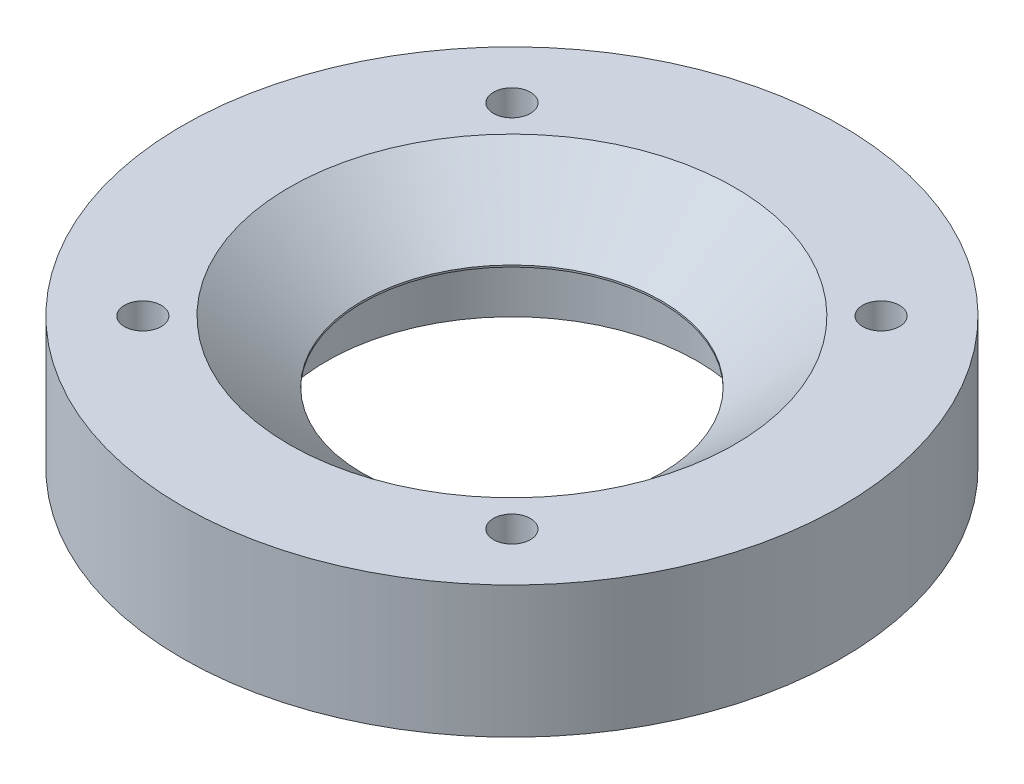
ISO-10303-21;
HEADER;
FILE_DESCRIPTION(('STEP AP214'),'2;1');
FILE_NAME('part.step','',(''),(''),'','','');
FILE_SCHEMA(('AUTOMOTIVE_DESIGN { 1 0 10303 214 1 1 1 1 }'));
ENDSEC;
DATA;
#1=APPLICATION_CONTEXT('core data for automotive mechanical design processes');
#2=APPLICATION_PROTOCOL_DEFINITION('international standard','automotive_design',2000,#1);
#3=PRODUCT_CONTEXT('',#1,'mechanical');
#4=PRODUCT('Part','Part','',(#3));
#5=PRODUCT_RELATED_PRODUCT_CATEGORY('part','',(#4));
#6=PRODUCT_DEFINITION_FORMATION('','',#4);
#7=PRODUCT_DEFINITION_CONTEXT('part definition',#1,'design');
#8=PRODUCT_DEFINITION('design','',#6,#7);
#9=PRODUCT_DEFINITION_SHAPE('','',#8);
#10=(LENGTH_UNIT() NAMED_UNIT(*) SI_UNIT(.MILLI.,.METRE.));
#11=(NAMED_UNIT(*) PLANE_ANGLE_UNIT() SI_UNIT($,.RADIAN.));
#12=(NAMED_UNIT(*) SI_UNIT($,.STERADIAN.) SOLID_ANGLE_UNIT());
#13=UNCERTAINTY_MEASURE_WITH_UNIT(LENGTH_MEASURE(1.E-05),#10,'distance_accuracy_value','');
#14=(GEOMETRIC_REPRESENTATION_CONTEXT(3) GLOBAL_UNCERTAINTY_ASSIGNED_CONTEXT((#13)) GLOBAL_UNIT_ASSIGNED_CONTEXT((#10,
#11,#12)) REPRESENTATION_CONTEXT('',''));
#15=CARTESIAN_POINT('',(0.,0.,0.));
#16=DIRECTION('',(0.,0.,1.));
#17=DIRECTION('',(1.,0.,0.));
#18=AXIS2_PLACEMENT_3D('',#15,#16,#17);
#19=CARTESIAN_POINT('',(0.,15.,0.));
#20=DIRECTION('',(0.,-1.,0.));
#21=DIRECTION('',(0.,0.,-1.));
#22=AXIS2_PLACEMENT_3D('',#19,#20,#21);
#23=CYLINDRICAL_SURFACE('',#22,37.5);
#24=CARTESIAN_POINT('',(0.,15.,0.));
#25=DIRECTION('',(0.,1.,0.));
#26=DIRECTION('',(0.,0.,1.));
#27=AXIS2_PLACEMENT_3D('',#24,#25,#26);
#28=CIRCLE('',#27,37.5);
#29=CARTESIAN_POINT('',(0.,15.,37.5));
#30=VERTEX_POINT('',#29);
#31=EDGE_CURVE('E44',#30,#30,#28,.T.);
#32=ORIENTED_EDGE('',*,*,#31,.F.);
#33=EDGE_LOOP('',(#32));
#34=FACE_BOUND('',#33,.T.);
#35=CARTESIAN_POINT('',(0.,0.,0.));
#36=DIRECTION('',(0.,1.,0.));
#37=DIRECTION('',(0.,0.,1.));
#38=AXIS2_PLACEMENT_3D('',#35,#36,#37);
#39=CIRCLE('',#38,37.5);
#40=CARTESIAN_POINT('',(0.,0.,37.5));
#41=VERTEX_POINT('',#40);
#42=EDGE_CURVE('E48',#41,#41,#39,.T.);
#43=ORIENTED_EDGE('',*,*,#42,.T.);
#44=EDGE_LOOP('',(#43));
#45=FACE_BOUND('',#44,.T.);
#46=ADVANCED_FACE('F33',(#34,#45),#23,.T.);
#47=CARTESIAN_POINT('',(0.,15.,0.));
#48=DIRECTION('',(0.,1.,0.));
#49=DIRECTION('',(0.,0.,1.));
#50=AXIS2_PLACEMENT_3D('',#47,#48,#49);
#51=PLANE('',#50);
#52=CARTESIAN_POINT('',(0.,15.,0.));
#53=DIRECTION('',(0.,1.,0.));
#54=DIRECTION('',(0.,0.,1.));
#55=AXIS2_PLACEMENT_3D('',#52,#53,#54);
#56=CIRCLE('',#55,25.3422751481595);
#57=CARTESIAN_POINT('',(0.,15.,25.3422751481595));
#58=VERTEX_POINT('',#57);
#59=EDGE_CURVE('E40',#58,#58,#56,.F.);
#60=ORIENTED_EDGE('',*,*,#59,.T.);
#61=EDGE_LOOP('',(#60));
#62=FACE_BOUND('',#61,.T.);
#63=CARTESIAN_POINT('',(-21.,15.,-21.));
#64=DIRECTION('',(0.,1.,0.));
#65=DIRECTION('',(0.,0.,1.));
#66=AXIS2_PLACEMENT_3D('',#63,#64,#65);
#67=CIRCLE('',#66,2.1);
#68=CARTESIAN_POINT('',(-21.,15.,-18.9));
#69=VERTEX_POINT('',#68);
#70=EDGE_CURVE('E81',#69,#69,#67,.T.);
#71=ORIENTED_EDGE('',*,*,#70,.F.);
#72=EDGE_LOOP('',(#71));
#73=FACE_BOUND('',#72,.T.);
#74=CARTESIAN_POINT('',(21.,15.,-21.));
#75=DIRECTION('',(0.,1.,0.));
#76=DIRECTION('',(0.,0.,1.));
#77=AXIS2_PLACEMENT_3D('',#74,#75,#76);
#78=CIRCLE('',#77,2.1);
#79=CARTESIAN_POINT('',(21.,15.,-18.9));
#80=VERTEX_POINT('',#79);
#81=EDGE_CURVE('E75',#80,#80,#78,.T.);
#82=ORIENTED_EDGE('',*,*,#81,.F.);
#83=EDGE_LOOP('',(#82));
#84=FACE_BOUND('',#83,.T.);
#85=CARTESIAN_POINT('',(21.,15.,21.));
#86=DIRECTION('',(0.,1.,0.));
#87=DIRECTION('',(0.,0.,1.));
#88=AXIS2_PLACEMENT_3D('',#85,#86,#87);
#89=CIRCLE('',#88,2.1);
#90=CARTESIAN_POINT('',(21.,15.,23.1));
#91=VERTEX_POINT('',#90);
#92=EDGE_CURVE('E69',#91,#91,#89,.T.);
#93=ORIENTED_EDGE('',*,*,#92,.F.);
#94=EDGE_LOOP('',(#93));
#95=FACE_BOUND('',#94,.T.);
#96=CARTESIAN_POINT('',(-21.,15.,21.));
#97=DIRECTION('',(0.,1.,0.));
#98=DIRECTION('',(0.,0.,1.));
#99=AXIS2_PLACEMENT_3D('',#96,#97,#98);
#100=CIRCLE('',#99,2.1);
#101=CARTESIAN_POINT('',(-21.,15.,23.1));
#102=VERTEX_POINT('',#101);
#103=EDGE_CURVE('E63',#102,#102,#100,.T.);
#104=ORIENTED_EDGE('',*,*,#103,.F.);
#105=EDGE_LOOP('',(#104));
#106=FACE_BOUND('',#105,.T.);
#107=ORIENTED_EDGE('',*,*,#31,.T.);
#108=EDGE_LOOP('',(#107));
#109=FACE_BOUND('',#108,.T.);
#110=ADVANCED_FACE('F97',(#62,#73,#84,#95,#106,#109),#51,.T.);
#111=CARTESIAN_POINT('',(0.,0.,0.));
#112=DIRECTION('',(0.,1.,0.));
#113=DIRECTION('',(0.,0.,1.));
#114=AXIS2_PLACEMENT_3D('',#111,#112,#113);
#115=PLANE('',#114);
#116=CARTESIAN_POINT('',(-21.,0.,-21.));
#117=DIRECTION('',(0.,1.,0.));
#118=DIRECTION('',(0.,0.,1.));
#119=AXIS2_PLACEMENT_3D('',#116,#117,#118);
#120=CIRCLE('',#119,2.1);
#121=CARTESIAN_POINT('',(-21.,0.,-18.9));
#122=VERTEX_POINT('',#121);
#123=EDGE_CURVE('E66',#122,#122,#120,.T.);
#124=ORIENTED_EDGE('',*,*,#123,.T.);
#125=EDGE_LOOP('',(#124));
#126=FACE_BOUND('',#125,.T.);
#127=CARTESIAN_POINT('',(21.,0.,-21.));
#128=DIRECTION('',(0.,1.,0.));
#129=DIRECTION('',(0.,0.,1.));
#130=AXIS2_PLACEMENT_3D('',#127,#128,#129);
#131=CIRCLE('',#130,2.1);
#132=CARTESIAN_POINT('',(21.,0.,-18.9));
#133=VERTEX_POINT('',#132);
#134=EDGE_CURVE('E78',#133,#133,#131,.T.);
#135=ORIENTED_EDGE('',*,*,#134,.T.);
#136=EDGE_LOOP('',(#135));
#137=FACE_BOUND('',#136,.T.);
#138=CARTESIAN_POINT('',(21.,0.,21.));
#139=DIRECTION('',(0.,1.,0.));
#140=DIRECTION('',(0.,0.,1.));
#141=AXIS2_PLACEMENT_3D('',#138,#139,#140);
#142=CIRCLE('',#141,2.1);
#143=CARTESIAN_POINT('',(21.,0.,23.1));
#144=VERTEX_POINT('',#143);
#145=EDGE_CURVE('E72',#144,#144,#142,.T.);
#146=ORIENTED_EDGE('',*,*,#145,.T.);
#147=EDGE_LOOP('',(#146));
#148=FACE_BOUND('',#147,.T.);
#149=CARTESIAN_POINT('',(-21.,0.,21.));
#150=DIRECTION('',(0.,1.,0.));
#151=DIRECTION('',(0.,0.,1.));
#152=AXIS2_PLACEMENT_3D('',#149,#150,#151);
#153=CIRCLE('',#152,2.1);
#154=CARTESIAN_POINT('',(-21.,0.,23.1));
#155=VERTEX_POINT('',#154);
#156=EDGE_CURVE('E62',#155,#155,#153,.T.);
#157=ORIENTED_EDGE('',*,*,#156,.T.);
#158=EDGE_LOOP('',(#157));
#159=FACE_BOUND('',#158,.T.);
#160=CARTESIAN_POINT('',(0.,0.,0.));
#161=DIRECTION('',(0.,-1.,0.));
#162=DIRECTION('',(0.,0.,-1.));
#163=AXIS2_PLACEMENT_3D('',#160,#161,#162);
#164=CIRCLE('',#163,21.1);
#165=CARTESIAN_POINT('',(0.,0.,-21.1));
#166=VERTEX_POINT('',#165);
#167=EDGE_CURVE('E54',#166,#166,#164,.T.);
#168=ORIENTED_EDGE('',*,*,#167,.F.);
#169=EDGE_LOOP('',(#168));
#170=FACE_BOUND('',#169,.T.);
#171=ORIENTED_EDGE('',*,*,#42,.F.);
#172=EDGE_LOOP('',(#171));
#173=FACE_BOUND('',#172,.T.);
#174=ADVANCED_FACE('F87',(#126,#137,#148,#159,#170,#173),#115,.F.);
#175=CARTESIAN_POINT('',(0.,7.8,0.));
#176=DIRECTION('',(0.,-1.,0.));
#177=DIRECTION('',(0.,0.,-1.));
#178=AXIS2_PLACEMENT_3D('',#175,#176,#177);
#179=CYLINDRICAL_SURFACE('',#178,21.1);
#180=CARTESIAN_POINT('',(0.,7.8,0.));
#181=DIRECTION('',(0.,-1.,0.));
#182=DIRECTION('',(0.,0.,-1.));
#183=AXIS2_PLACEMENT_3D('',#180,#181,#182);
#184=CIRCLE('',#183,21.1);
#185=CARTESIAN_POINT('',(0.,7.8,-21.1));
#186=VERTEX_POINT('',#185);
#187=EDGE_CURVE('E52',#186,#186,#184,.T.);
#188=ORIENTED_EDGE('',*,*,#187,.F.);
#189=EDGE_LOOP('',(#188));
#190=FACE_BOUND('',#189,.T.);
#191=ORIENTED_EDGE('',*,*,#167,.T.);
#192=EDGE_LOOP('',(#191));
#193=FACE_BOUND('',#192,.T.);
#194=ADVANCED_FACE('F114',(#190,#193),#179,.F.);
#195=CARTESIAN_POINT('',(0.,7.8,0.));
#196=DIRECTION('',(0.,-1.,0.));
#197=DIRECTION('',(0.,0.,-1.));
#198=AXIS2_PLACEMENT_3D('',#195,#196,#197);
#199=PLANE('',#198);
#200=CARTESIAN_POINT('',(0.,7.8,0.));
#201=DIRECTION('',(0.,-1.,0.));
#202=DIRECTION('',(0.,0.,-1.));
#203=AXIS2_PLACEMENT_3D('',#200,#201,#202);
#204=CIRCLE('',#203,17.);
#205=CARTESIAN_POINT('',(0.,7.8,-17.));
#206=VERTEX_POINT('',#205);
#207=EDGE_CURVE('E57',#206,#206,#204,.T.);
#208=ORIENTED_EDGE('',*,*,#207,.F.);
#209=EDGE_LOOP('',(#208));
#210=FACE_BOUND('',#209,.T.);
#211=ORIENTED_EDGE('',*,*,#187,.T.);
#212=EDGE_LOOP('',(#211));
#213=FACE_BOUND('',#212,.T.);
#214=ADVANCED_FACE('F120',(#210,#213),#199,.T.);
#215=CARTESIAN_POINT('',(0.,15.,0.));
#216=DIRECTION('',(0.,-1.,0.));
#217=DIRECTION('',(0.,0.,-1.));
#218=AXIS2_PLACEMENT_3D('',#215,#216,#217);
#219=CYLINDRICAL_SURFACE('',#218,17.);
#220=CARTESIAN_POINT('',(0.,7.99999999999998,0.));
#221=DIRECTION('',(0.,1.,0.));
#222=DIRECTION('',(0.,0.,1.));
#223=AXIS2_PLACEMENT_3D('',#220,#221,#222);
#224=CIRCLE('',#223,17.);
#225=CARTESIAN_POINT('',(0.,7.99999999999998,17.));
#226=VERTEX_POINT('',#225);
#227=EDGE_CURVE('E10',#226,#226,#224,.T.);
#228=ORIENTED_EDGE('',*,*,#227,.T.);
#229=EDGE_LOOP('',(#228));
#230=FACE_BOUND('',#229,.T.);
#231=ORIENTED_EDGE('',*,*,#207,.T.);
#232=EDGE_LOOP('',(#231));
#233=FACE_BOUND('',#232,.T.);
#234=ADVANCED_FACE('F126',(#230,#233),#219,.F.);
#235=CARTESIAN_POINT('',(-21.,0.,21.));
#236=DIRECTION('',(0.,1.,0.));
#237=DIRECTION('',(0.,0.,1.));
#238=AXIS2_PLACEMENT_3D('',#235,#236,#237);
#239=CYLINDRICAL_SURFACE('',#238,2.1);
#240=ORIENTED_EDGE('',*,*,#156,.F.);
#241=EDGE_LOOP('',(#240));
#242=FACE_BOUND('',#241,.T.);
#243=ORIENTED_EDGE('',*,*,#103,.T.);
#244=EDGE_LOOP('',(#243));
#245=FACE_BOUND('',#244,.T.);
#246=ADVANCED_FACE('F130',(#242,#245),#239,.F.);
#247=CARTESIAN_POINT('',(21.,0.,21.));
#248=DIRECTION('',(0.,1.,0.));
#249=DIRECTION('',(0.,0.,1.));
#250=AXIS2_PLACEMENT_3D('',#247,#248,#249);
#251=CYLINDRICAL_SURFACE('',#250,2.1);
#252=ORIENTED_EDGE('',*,*,#145,.F.);
#253=EDGE_LOOP('',(#252));
#254=FACE_BOUND('',#253,.T.);
#255=ORIENTED_EDGE('',*,*,#92,.T.);
#256=EDGE_LOOP('',(#255));
#257=FACE_BOUND('',#256,.T.);
#258=ADVANCED_FACE('F133',(#254,#257),#251,.F.);
#259=CARTESIAN_POINT('',(21.,0.,-21.));
#260=DIRECTION('',(0.,1.,0.));
#261=DIRECTION('',(0.,0.,1.));
#262=AXIS2_PLACEMENT_3D('',#259,#260,#261);
#263=CYLINDRICAL_SURFACE('',#262,2.1);
#264=ORIENTED_EDGE('',*,*,#134,.F.);
#265=EDGE_LOOP('',(#264));
#266=FACE_BOUND('',#265,.T.);
#267=ORIENTED_EDGE('',*,*,#81,.T.);
#268=EDGE_LOOP('',(#267));
#269=FACE_BOUND('',#268,.T.);
#270=ADVANCED_FACE('F93',(#266,#269),#263,.F.);
#271=CARTESIAN_POINT('',(-21.,0.,-21.));
#272=DIRECTION('',(0.,1.,0.));
#273=DIRECTION('',(0.,0.,1.));
#274=AXIS2_PLACEMENT_3D('',#271,#272,#273);
#275=CYLINDRICAL_SURFACE('',#274,2.1);
#276=ORIENTED_EDGE('',*,*,#123,.F.);
#277=EDGE_LOOP('',(#276));
#278=FACE_BOUND('',#277,.T.);
#279=ORIENTED_EDGE('',*,*,#70,.T.);
#280=EDGE_LOOP('',(#279));
#281=FACE_BOUND('',#280,.T.);
#282=ADVANCED_FACE('F90',(#278,#281),#275,.F.);
#283=CARTESIAN_POINT('',(0.,15.,0.));
#284=DIRECTION('',(0.,1.,0.));
#285=DIRECTION('',(0.,0.,1.));
#286=AXIS2_PLACEMENT_3D('',#283,#284,#285);
#287=CONICAL_SURFACE('',#286,25.3422751481595,0.872664625997163);
#288=ORIENTED_EDGE('',*,*,#227,.F.);
#289=EDGE_LOOP('',(#288));
#290=FACE_BOUND('',#289,.T.);
#291=ORIENTED_EDGE('',*,*,#59,.F.);
#292=EDGE_LOOP('',(#291));
#293=FACE_BOUND('',#292,.T.);
#294=ADVANCED_FACE('F35',(#290,#293),#287,.F.);
#295=CLOSED_SHELL('',(#46,#110,#174,#194,#214,#234,#246,#258,#270,#282,#294));
#296=MANIFOLD_SOLID_BREP('B2',#295);
#297=ADVANCED_BREP_SHAPE_REPRESENTATION('',(#18,#296),#14);
#298=SHAPE_DEFINITION_REPRESENTATION(#9,#297);
ENDSEC;
END-ISO-10303-21;
